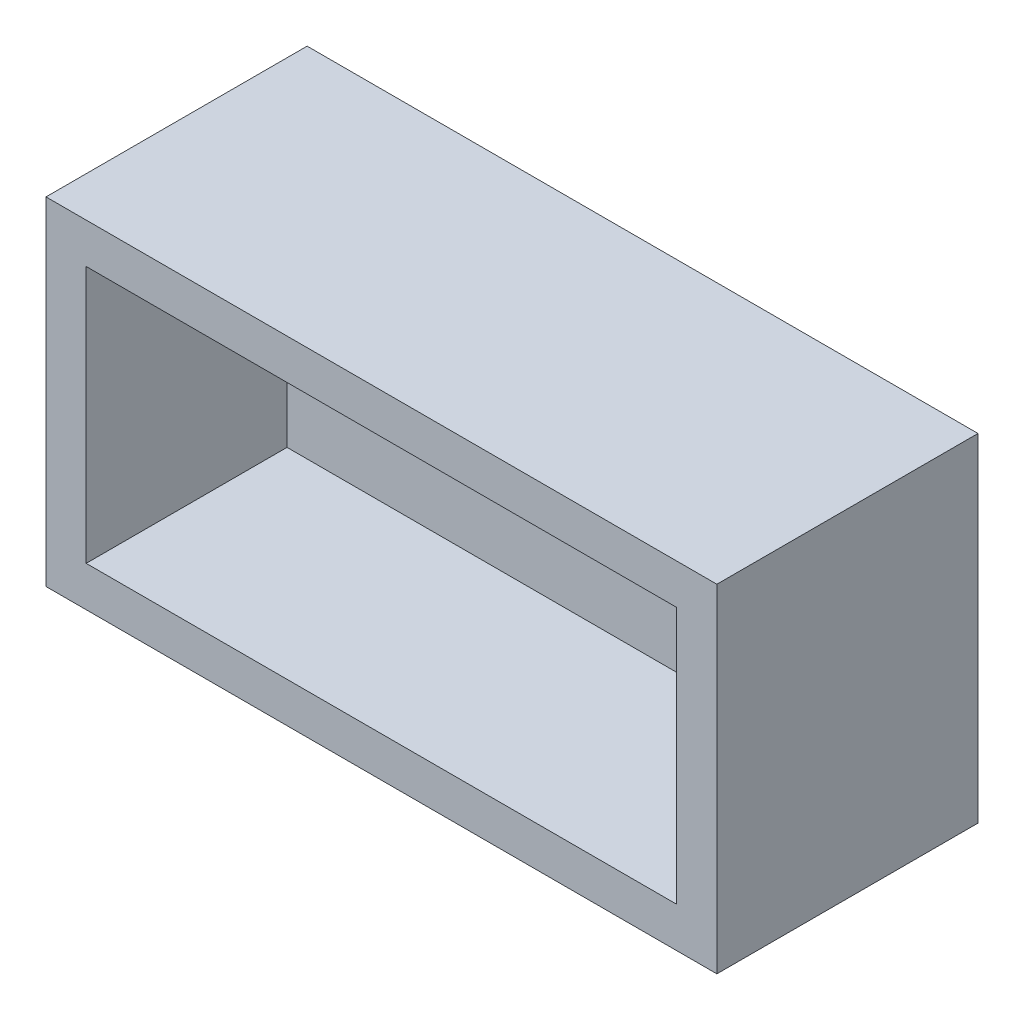
ISO-10303-21;
HEADER;
FILE_DESCRIPTION(('STEP AP214'),'2;1');
FILE_NAME('part.step','',(''),(''),'','','');
FILE_SCHEMA(('AUTOMOTIVE_DESIGN { 1 0 10303 214 1 1 1 1 }'));
ENDSEC;
DATA;
#1=APPLICATION_CONTEXT('core data for automotive mechanical design processes');
#2=APPLICATION_PROTOCOL_DEFINITION('international standard','automotive_design',2000,#1);
#3=PRODUCT_CONTEXT('',#1,'mechanical');
#4=PRODUCT('Part','Part','',(#3));
#5=PRODUCT_RELATED_PRODUCT_CATEGORY('part','',(#4));
#6=PRODUCT_DEFINITION_FORMATION('','',#4);
#7=PRODUCT_DEFINITION_CONTEXT('part definition',#1,'design');
#8=PRODUCT_DEFINITION('design','',#6,#7);
#9=PRODUCT_DEFINITION_SHAPE('','',#8);
#10=(LENGTH_UNIT() NAMED_UNIT(*) SI_UNIT(.MILLI.,.METRE.));
#11=(NAMED_UNIT(*) PLANE_ANGLE_UNIT() SI_UNIT($,.RADIAN.));
#12=(NAMED_UNIT(*) SI_UNIT($,.STERADIAN.) SOLID_ANGLE_UNIT());
#13=UNCERTAINTY_MEASURE_WITH_UNIT(LENGTH_MEASURE(1.E-05),#10,'distance_accuracy_value','');
#14=(GEOMETRIC_REPRESENTATION_CONTEXT(3) GLOBAL_UNCERTAINTY_ASSIGNED_CONTEXT((#13)) GLOBAL_UNIT_ASSIGNED_CONTEXT((#10,
#11,#12)) REPRESENTATION_CONTEXT('',''));
#15=CARTESIAN_POINT('',(0.,0.,0.));
#16=DIRECTION('',(0.,0.,1.));
#17=DIRECTION('',(1.,0.,0.));
#18=AXIS2_PLACEMENT_3D('',#15,#16,#17);
#19=CARTESIAN_POINT('',(16.7,-8.4,13.));
#20=DIRECTION('',(-1.,0.,0.));
#21=DIRECTION('',(0.,0.,1.));
#22=AXIS2_PLACEMENT_3D('',#19,#20,#21);
#23=PLANE('',#22);
#24=DIRECTION('',(0.,1.,0.));
#25=VECTOR('',#24,1.);
#26=CARTESIAN_POINT('',(16.7,-8.4,0.));
#27=LINE('',#26,#25);
#28=CARTESIAN_POINT('',(16.7,-8.4,0.));
#29=VERTEX_POINT('',#28);
#30=CARTESIAN_POINT('',(16.7,8.4,0.));
#31=VERTEX_POINT('',#30);
#32=EDGE_CURVE('E143',#29,#31,#27,.T.);
#33=ORIENTED_EDGE('',*,*,#32,.T.);
#34=DIRECTION('',(0.,0.,-1.));
#35=VECTOR('',#34,1.);
#36=CARTESIAN_POINT('',(16.7,8.4,13.));
#37=LINE('',#36,#35);
#38=CARTESIAN_POINT('',(16.7,8.4,13.));
#39=VERTEX_POINT('',#38);
#40=EDGE_CURVE('E11',#39,#31,#37,.T.);
#41=ORIENTED_EDGE('',*,*,#40,.F.);
#42=DIRECTION('',(0.,1.,0.));
#43=VECTOR('',#42,1.);
#44=CARTESIAN_POINT('',(16.7,-8.4,13.));
#45=LINE('',#44,#43);
#46=CARTESIAN_POINT('',(16.7,-8.4,13.));
#47=VERTEX_POINT('',#46);
#48=EDGE_CURVE('E147',#47,#39,#45,.T.);
#49=ORIENTED_EDGE('',*,*,#48,.F.);
#50=DIRECTION('',(0.,0.,-1.));
#51=VECTOR('',#50,1.);
#52=CARTESIAN_POINT('',(16.7,-8.4,13.));
#53=LINE('',#52,#51);
#54=EDGE_CURVE('E153',#47,#29,#53,.T.);
#55=ORIENTED_EDGE('',*,*,#54,.T.);
#56=EDGE_LOOP('',(#33,#41,#49,#55));
#57=FACE_BOUND('',#56,.T.);
#58=ADVANCED_FACE('F35',(#57),#23,.F.);
#59=CARTESIAN_POINT('',(-16.7,8.4,13.));
#60=DIRECTION('',(0.,-1.,0.));
#61=DIRECTION('',(0.,0.,-1.));
#62=AXIS2_PLACEMENT_3D('',#59,#60,#61);
#63=PLANE('',#62);
#64=DIRECTION('',(-1.,0.,0.));
#65=VECTOR('',#64,1.);
#66=CARTESIAN_POINT('',(-16.7,8.4,0.));
#67=LINE('',#66,#65);
#68=CARTESIAN_POINT('',(-16.7,8.4,0.));
#69=VERTEX_POINT('',#68);
#70=EDGE_CURVE('E156',#31,#69,#67,.T.);
#71=ORIENTED_EDGE('',*,*,#70,.T.);
#72=DIRECTION('',(0.,0.,-1.));
#73=VECTOR('',#72,1.);
#74=CARTESIAN_POINT('',(-16.7,8.4,13.));
#75=LINE('',#74,#73);
#76=CARTESIAN_POINT('',(-16.7,8.4,13.));
#77=VERTEX_POINT('',#76);
#78=EDGE_CURVE('E42',#77,#69,#75,.T.);
#79=ORIENTED_EDGE('',*,*,#78,.F.);
#80=DIRECTION('',(-1.,0.,0.));
#81=VECTOR('',#80,1.);
#82=CARTESIAN_POINT('',(-16.7,8.4,13.));
#83=LINE('',#82,#81);
#84=EDGE_CURVE('E86',#39,#77,#83,.T.);
#85=ORIENTED_EDGE('',*,*,#84,.F.);
#86=ORIENTED_EDGE('',*,*,#40,.T.);
#87=EDGE_LOOP('',(#71,#79,#85,#86));
#88=FACE_BOUND('',#87,.T.);
#89=ADVANCED_FACE('F185',(#88),#63,.F.);
#90=CARTESIAN_POINT('',(-16.7,-8.4,13.));
#91=DIRECTION('',(1.,0.,0.));
#92=DIRECTION('',(0.,0.,-1.));
#93=AXIS2_PLACEMENT_3D('',#90,#91,#92);
#94=PLANE('',#93);
#95=DIRECTION('',(0.,-1.,0.));
#96=VECTOR('',#95,1.);
#97=CARTESIAN_POINT('',(-16.7,-8.4,0.));
#98=LINE('',#97,#96);
#99=CARTESIAN_POINT('',(-16.7,-8.4,0.));
#100=VERTEX_POINT('',#99);
#101=EDGE_CURVE('E158',#69,#100,#98,.T.);
#102=ORIENTED_EDGE('',*,*,#101,.T.);
#103=DIRECTION('',(0.,0.,-1.));
#104=VECTOR('',#103,1.);
#105=CARTESIAN_POINT('',(-16.7,-8.4,13.));
#106=LINE('',#105,#104);
#107=CARTESIAN_POINT('',(-16.7,-8.4,13.));
#108=VERTEX_POINT('',#107);
#109=EDGE_CURVE('E162',#108,#100,#106,.T.);
#110=ORIENTED_EDGE('',*,*,#109,.F.);
#111=DIRECTION('',(0.,-1.,0.));
#112=VECTOR('',#111,1.);
#113=CARTESIAN_POINT('',(-16.7,-8.4,13.));
#114=LINE('',#113,#112);
#115=EDGE_CURVE('E150',#77,#108,#114,.T.);
#116=ORIENTED_EDGE('',*,*,#115,.F.);
#117=ORIENTED_EDGE('',*,*,#78,.T.);
#118=EDGE_LOOP('',(#102,#110,#116,#117));
#119=FACE_BOUND('',#118,.T.);
#120=ADVANCED_FACE('F167',(#119),#94,.F.);
#121=CARTESIAN_POINT('',(-16.7,-8.4,13.));
#122=DIRECTION('',(0.,1.,0.));
#123=DIRECTION('',(0.,0.,1.));
#124=AXIS2_PLACEMENT_3D('',#121,#122,#123);
#125=PLANE('',#124);
#126=DIRECTION('',(1.,0.,0.));
#127=VECTOR('',#126,1.);
#128=CARTESIAN_POINT('',(-16.7,-8.4,0.));
#129=LINE('',#128,#127);
#130=EDGE_CURVE('E79',#100,#29,#129,.T.);
#131=ORIENTED_EDGE('',*,*,#130,.T.);
#132=ORIENTED_EDGE('',*,*,#54,.F.);
#133=DIRECTION('',(1.,0.,0.));
#134=VECTOR('',#133,1.);
#135=CARTESIAN_POINT('',(-16.7,-8.4,13.));
#136=LINE('',#135,#134);
#137=EDGE_CURVE('E58',#108,#47,#136,.T.);
#138=ORIENTED_EDGE('',*,*,#137,.F.);
#139=ORIENTED_EDGE('',*,*,#109,.T.);
#140=EDGE_LOOP('',(#131,#132,#138,#139));
#141=FACE_BOUND('',#140,.T.);
#142=ADVANCED_FACE('F175',(#141),#125,.F.);
#143=CARTESIAN_POINT('',(0.,0.,13.));
#144=DIRECTION('',(0.,0.,-1.));
#145=DIRECTION('',(-1.,0.,0.));
#146=AXIS2_PLACEMENT_3D('',#143,#144,#145);
#147=PLANE('',#146);
#148=DIRECTION('',(1.,0.,0.));
#149=VECTOR('',#148,1.);
#150=CARTESIAN_POINT('',(-14.7,-6.4,13.));
#151=LINE('',#150,#149);
#152=CARTESIAN_POINT('',(-14.7,-6.4,13.));
#153=VERTEX_POINT('',#152);
#154=CARTESIAN_POINT('',(14.7,-6.4,13.));
#155=VERTEX_POINT('',#154);
#156=EDGE_CURVE('E137',#153,#155,#151,.T.);
#157=ORIENTED_EDGE('',*,*,#156,.F.);
#158=DIRECTION('',(0.,-1.,0.));
#159=VECTOR('',#158,1.);
#160=CARTESIAN_POINT('',(-14.7,6.4,13.));
#161=LINE('',#160,#159);
#162=CARTESIAN_POINT('',(-14.7,6.4,13.));
#163=VERTEX_POINT('',#162);
#164=EDGE_CURVE('E49',#163,#153,#161,.T.);
#165=ORIENTED_EDGE('',*,*,#164,.F.);
#166=DIRECTION('',(-1.,0.,0.));
#167=VECTOR('',#166,1.);
#168=CARTESIAN_POINT('',(-14.7,6.4,13.));
#169=LINE('',#168,#167);
#170=CARTESIAN_POINT('',(14.7,6.4,13.));
#171=VERTEX_POINT('',#170);
#172=EDGE_CURVE('E128',#171,#163,#169,.T.);
#173=ORIENTED_EDGE('',*,*,#172,.F.);
#174=DIRECTION('',(0.,1.,0.));
#175=VECTOR('',#174,1.);
#176=CARTESIAN_POINT('',(14.7,6.4,13.));
#177=LINE('',#176,#175);
#178=EDGE_CURVE('E131',#155,#171,#177,.T.);
#179=ORIENTED_EDGE('',*,*,#178,.F.);
#180=EDGE_LOOP('',(#157,#165,#173,#179));
#181=FACE_BOUND('',#180,.T.);
#182=ORIENTED_EDGE('',*,*,#48,.T.);
#183=ORIENTED_EDGE('',*,*,#84,.T.);
#184=ORIENTED_EDGE('',*,*,#115,.T.);
#185=ORIENTED_EDGE('',*,*,#137,.T.);
#186=EDGE_LOOP('',(#182,#183,#184,#185));
#187=FACE_BOUND('',#186,.T.);
#188=ADVANCED_FACE('F177',(#181,#187),#147,.F.);
#189=CARTESIAN_POINT('',(0.,0.,0.));
#190=DIRECTION('',(0.,0.,-1.));
#191=DIRECTION('',(-1.,0.,0.));
#192=AXIS2_PLACEMENT_3D('',#189,#190,#191);
#193=PLANE('',#192);
#194=ORIENTED_EDGE('',*,*,#32,.F.);
#195=ORIENTED_EDGE('',*,*,#130,.F.);
#196=ORIENTED_EDGE('',*,*,#101,.F.);
#197=ORIENTED_EDGE('',*,*,#70,.F.);
#198=EDGE_LOOP('',(#194,#195,#196,#197));
#199=FACE_BOUND('',#198,.T.);
#200=ADVANCED_FACE('F171',(#199),#193,.T.);
#201=CARTESIAN_POINT('',(-14.7,6.4,3.));
#202=DIRECTION('',(-1.,0.,0.));
#203=DIRECTION('',(0.,-1.,0.));
#204=AXIS2_PLACEMENT_3D('',#201,#202,#203);
#205=PLANE('',#204);
#206=ORIENTED_EDGE('',*,*,#164,.T.);
#207=DIRECTION('',(0.,0.,1.));
#208=VECTOR('',#207,1.);
#209=CARTESIAN_POINT('',(-14.7,-6.4,3.));
#210=LINE('',#209,#208);
#211=CARTESIAN_POINT('',(-14.7,-6.4,3.));
#212=VERTEX_POINT('',#211);
#213=EDGE_CURVE('E106',#212,#153,#210,.T.);
#214=ORIENTED_EDGE('',*,*,#213,.F.);
#215=DIRECTION('',(0.,-1.,0.));
#216=VECTOR('',#215,1.);
#217=CARTESIAN_POINT('',(-14.7,6.4,3.));
#218=LINE('',#217,#216);
#219=CARTESIAN_POINT('',(-14.7,6.4,3.));
#220=VERTEX_POINT('',#219);
#221=EDGE_CURVE('E110',#220,#212,#218,.T.);
#222=ORIENTED_EDGE('',*,*,#221,.F.);
#223=DIRECTION('',(0.,0.,1.));
#224=VECTOR('',#223,1.);
#225=CARTESIAN_POINT('',(-14.7,6.4,3.));
#226=LINE('',#225,#224);
#227=EDGE_CURVE('E141',#220,#163,#226,.T.);
#228=ORIENTED_EDGE('',*,*,#227,.T.);
#229=EDGE_LOOP('',(#206,#214,#222,#228));
#230=FACE_BOUND('',#229,.T.);
#231=ADVANCED_FACE('F108',(#230),#205,.F.);
#232=CARTESIAN_POINT('',(-14.7,6.4,3.));
#233=DIRECTION('',(0.,1.,0.));
#234=DIRECTION('',(0.,0.,1.));
#235=AXIS2_PLACEMENT_3D('',#232,#233,#234);
#236=PLANE('',#235);
#237=ORIENTED_EDGE('',*,*,#172,.T.);
#238=ORIENTED_EDGE('',*,*,#227,.F.);
#239=DIRECTION('',(-1.,0.,0.));
#240=VECTOR('',#239,1.);
#241=CARTESIAN_POINT('',(-14.7,6.4,3.));
#242=LINE('',#241,#240);
#243=CARTESIAN_POINT('',(14.7,6.4,3.));
#244=VERTEX_POINT('',#243);
#245=EDGE_CURVE('E116',#244,#220,#242,.T.);
#246=ORIENTED_EDGE('',*,*,#245,.F.);
#247=DIRECTION('',(0.,0.,1.));
#248=VECTOR('',#247,1.);
#249=CARTESIAN_POINT('',(14.7,6.4,3.));
#250=LINE('',#249,#248);
#251=EDGE_CURVE('E144',#244,#171,#250,.T.);
#252=ORIENTED_EDGE('',*,*,#251,.T.);
#253=EDGE_LOOP('',(#237,#238,#246,#252));
#254=FACE_BOUND('',#253,.T.);
#255=ADVANCED_FACE('F224',(#254),#236,.F.);
#256=CARTESIAN_POINT('',(14.7,6.4,3.));
#257=DIRECTION('',(1.,0.,0.));
#258=DIRECTION('',(0.,1.,0.));
#259=AXIS2_PLACEMENT_3D('',#256,#257,#258);
#260=PLANE('',#259);
#261=ORIENTED_EDGE('',*,*,#178,.T.);
#262=ORIENTED_EDGE('',*,*,#251,.F.);
#263=DIRECTION('',(0.,1.,0.));
#264=VECTOR('',#263,1.);
#265=CARTESIAN_POINT('',(14.7,6.4,3.));
#266=LINE('',#265,#264);
#267=CARTESIAN_POINT('',(14.7,-6.4,3.));
#268=VERTEX_POINT('',#267);
#269=EDGE_CURVE('E124',#268,#244,#266,.T.);
#270=ORIENTED_EDGE('',*,*,#269,.F.);
#271=DIRECTION('',(0.,0.,1.));
#272=VECTOR('',#271,1.);
#273=CARTESIAN_POINT('',(14.7,-6.4,3.));
#274=LINE('',#273,#272);
#275=EDGE_CURVE('E115',#268,#155,#274,.T.);
#276=ORIENTED_EDGE('',*,*,#275,.T.);
#277=EDGE_LOOP('',(#261,#262,#270,#276));
#278=FACE_BOUND('',#277,.T.);
#279=ADVANCED_FACE('F233',(#278),#260,.F.);
#280=CARTESIAN_POINT('',(-14.7,-6.4,3.));
#281=DIRECTION('',(0.,-1.,0.));
#282=DIRECTION('',(0.,0.,-1.));
#283=AXIS2_PLACEMENT_3D('',#280,#281,#282);
#284=PLANE('',#283);
#285=ORIENTED_EDGE('',*,*,#156,.T.);
#286=ORIENTED_EDGE('',*,*,#275,.F.);
#287=DIRECTION('',(1.,0.,0.));
#288=VECTOR('',#287,1.);
#289=CARTESIAN_POINT('',(-14.7,-6.4,3.));
#290=LINE('',#289,#288);
#291=EDGE_CURVE('E119',#212,#268,#290,.T.);
#292=ORIENTED_EDGE('',*,*,#291,.F.);
#293=ORIENTED_EDGE('',*,*,#213,.T.);
#294=EDGE_LOOP('',(#285,#286,#292,#293));
#295=FACE_BOUND('',#294,.T.);
#296=ADVANCED_FACE('F120',(#295),#284,.F.);
#297=CARTESIAN_POINT('',(0.,0.,3.));
#298=DIRECTION('',(0.,0.,1.));
#299=DIRECTION('',(1.,0.,0.));
#300=AXIS2_PLACEMENT_3D('',#297,#298,#299);
#301=PLANE('',#300);
#302=ORIENTED_EDGE('',*,*,#221,.T.);
#303=ORIENTED_EDGE('',*,*,#291,.T.);
#304=ORIENTED_EDGE('',*,*,#269,.T.);
#305=ORIENTED_EDGE('',*,*,#245,.T.);
#306=EDGE_LOOP('',(#302,#303,#304,#305));
#307=FACE_BOUND('',#306,.T.);
#308=ADVANCED_FACE('F126',(#307),#301,.T.);
#309=CLOSED_SHELL('',(#58,#89,#120,#142,#188,#200,#231,#255,#279,#296,#308));
#310=MANIFOLD_SOLID_BREP('B2',#309);
#311=ADVANCED_BREP_SHAPE_REPRESENTATION('',(#18,#310),#14);
#312=SHAPE_DEFINITION_REPRESENTATION(#9,#311);
ENDSEC;
END-ISO-10303-21;
